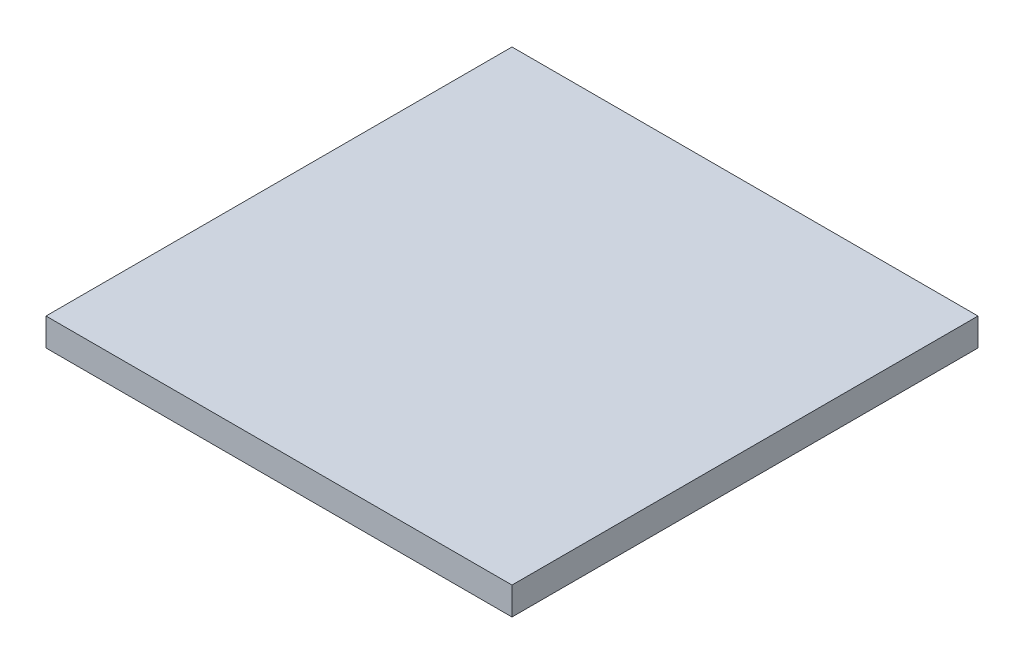
ISO-10303-21;
HEADER;
FILE_DESCRIPTION(('STEP AP214'),'2;1');
FILE_NAME('part.step','',(''),(''),'','','');
FILE_SCHEMA(('AUTOMOTIVE_DESIGN { 1 0 10303 214 1 1 1 1 }'));
ENDSEC;
DATA;
#1=APPLICATION_CONTEXT('core data for automotive mechanical design processes');
#2=APPLICATION_PROTOCOL_DEFINITION('international standard','automotive_design',2000,#1);
#3=PRODUCT_CONTEXT('',#1,'mechanical');
#4=PRODUCT('Part','Part','',(#3));
#5=PRODUCT_RELATED_PRODUCT_CATEGORY('part','',(#4));
#6=PRODUCT_DEFINITION_FORMATION('','',#4);
#7=PRODUCT_DEFINITION_CONTEXT('part definition',#1,'design');
#8=PRODUCT_DEFINITION('design','',#6,#7);
#9=PRODUCT_DEFINITION_SHAPE('','',#8);
#10=(LENGTH_UNIT() NAMED_UNIT(*) SI_UNIT(.MILLI.,.METRE.));
#11=(NAMED_UNIT(*) PLANE_ANGLE_UNIT() SI_UNIT($,.RADIAN.));
#12=(NAMED_UNIT(*) SI_UNIT($,.STERADIAN.) SOLID_ANGLE_UNIT());
#13=UNCERTAINTY_MEASURE_WITH_UNIT(LENGTH_MEASURE(1.E-05),#10,'distance_accuracy_value','');
#14=(GEOMETRIC_REPRESENTATION_CONTEXT(3) GLOBAL_UNCERTAINTY_ASSIGNED_CONTEXT((#13)) GLOBAL_UNIT_ASSIGNED_CONTEXT((#10,
#11,#12)) REPRESENTATION_CONTEXT('',''));
#15=CARTESIAN_POINT('',(0.,0.,0.));
#16=DIRECTION('',(0.,0.,1.));
#17=DIRECTION('',(1.,0.,0.));
#18=AXIS2_PLACEMENT_3D('',#15,#16,#17);
#19=CARTESIAN_POINT('',(0.,0.,0.));
#20=DIRECTION('',(0.,1.,0.));
#21=DIRECTION('',(1.,0.,0.));
#22=AXIS2_PLACEMENT_3D('',#19,#20,#21);
#23=PLANE('',#22);
#24=DIRECTION('',(-1.,0.,0.));
#25=VECTOR('',#24,1.);
#26=CARTESIAN_POINT('',(1.85,0.,-1.85));
#27=LINE('',#26,#25);
#28=CARTESIAN_POINT('',(1.85,0.,-1.85));
#29=VERTEX_POINT('',#28);
#30=CARTESIAN_POINT('',(-1.85,0.,-1.85));
#31=VERTEX_POINT('',#30);
#32=EDGE_CURVE('E11',#29,#31,#27,.T.);
#33=ORIENTED_EDGE('',*,*,#32,.F.);
#34=DIRECTION('',(0.,0.,-1.));
#35=VECTOR('',#34,1.);
#36=CARTESIAN_POINT('',(1.85,0.,1.85));
#37=LINE('',#36,#35);
#38=CARTESIAN_POINT('',(1.85,0.,1.85));
#39=VERTEX_POINT('',#38);
#40=EDGE_CURVE('E24',#39,#29,#37,.T.);
#41=ORIENTED_EDGE('',*,*,#40,.F.);
#42=DIRECTION('',(1.,0.,0.));
#43=VECTOR('',#42,1.);
#44=CARTESIAN_POINT('',(-1.85,0.,1.85));
#45=LINE('',#44,#43);
#46=CARTESIAN_POINT('',(-1.85,0.,1.85));
#47=VERTEX_POINT('',#46);
#48=EDGE_CURVE('E61',#47,#39,#45,.T.);
#49=ORIENTED_EDGE('',*,*,#48,.F.);
#50=DIRECTION('',(0.,0.,1.));
#51=VECTOR('',#50,1.);
#52=CARTESIAN_POINT('',(-1.85,0.,-1.85));
#53=LINE('',#52,#51);
#54=EDGE_CURVE('E37',#31,#47,#53,.T.);
#55=ORIENTED_EDGE('',*,*,#54,.F.);
#56=EDGE_LOOP('',(#33,#41,#49,#55));
#57=FACE_BOUND('',#56,.T.);
#58=ADVANCED_FACE('F17',(#57),#23,.F.);
#59=CARTESIAN_POINT('',(-1.85,0.,-1.85));
#60=DIRECTION('',(-1.,0.,0.));
#61=DIRECTION('',(0.,0.,1.));
#62=AXIS2_PLACEMENT_3D('',#59,#60,#61);
#63=PLANE('',#62);
#64=DIRECTION('',(0.,1.,0.));
#65=VECTOR('',#64,1.);
#66=CARTESIAN_POINT('',(-1.85,0.,1.85));
#67=LINE('',#66,#65);
#68=CARTESIAN_POINT('',(-1.85,0.22,1.85));
#69=VERTEX_POINT('',#68);
#70=EDGE_CURVE('E84',#47,#69,#67,.T.);
#71=ORIENTED_EDGE('',*,*,#70,.T.);
#72=DIRECTION('',(0.,0.,1.));
#73=VECTOR('',#72,1.);
#74=CARTESIAN_POINT('',(-1.85,0.22,-1.85));
#75=LINE('',#74,#73);
#76=CARTESIAN_POINT('',(-1.85,0.22,-1.85));
#77=VERTEX_POINT('',#76);
#78=EDGE_CURVE('E74',#77,#69,#75,.T.);
#79=ORIENTED_EDGE('',*,*,#78,.F.);
#80=DIRECTION('',(0.,1.,0.));
#81=VECTOR('',#80,1.);
#82=CARTESIAN_POINT('',(-1.85,0.,-1.85));
#83=LINE('',#82,#81);
#84=EDGE_CURVE('E81',#31,#77,#83,.T.);
#85=ORIENTED_EDGE('',*,*,#84,.F.);
#86=ORIENTED_EDGE('',*,*,#54,.T.);
#87=EDGE_LOOP('',(#71,#79,#85,#86));
#88=FACE_BOUND('',#87,.T.);
#89=ADVANCED_FACE('F89',(#88),#63,.T.);
#90=CARTESIAN_POINT('',(1.85,0.,-1.85));
#91=DIRECTION('',(0.,0.,-1.));
#92=DIRECTION('',(-1.,0.,0.));
#93=AXIS2_PLACEMENT_3D('',#90,#91,#92);
#94=PLANE('',#93);
#95=ORIENTED_EDGE('',*,*,#84,.T.);
#96=DIRECTION('',(-1.,0.,0.));
#97=VECTOR('',#96,1.);
#98=CARTESIAN_POINT('',(1.85,0.22,-1.85));
#99=LINE('',#98,#97);
#100=CARTESIAN_POINT('',(1.85,0.22,-1.85));
#101=VERTEX_POINT('',#100);
#102=EDGE_CURVE('E79',#101,#77,#99,.T.);
#103=ORIENTED_EDGE('',*,*,#102,.F.);
#104=DIRECTION('',(0.,1.,0.));
#105=VECTOR('',#104,1.);
#106=CARTESIAN_POINT('',(1.85,0.,-1.85));
#107=LINE('',#106,#105);
#108=EDGE_CURVE('E67',#29,#101,#107,.T.);
#109=ORIENTED_EDGE('',*,*,#108,.F.);
#110=ORIENTED_EDGE('',*,*,#32,.T.);
#111=EDGE_LOOP('',(#95,#103,#109,#110));
#112=FACE_BOUND('',#111,.T.);
#113=ADVANCED_FACE('F91',(#112),#94,.T.);
#114=CARTESIAN_POINT('',(1.85,0.,1.85));
#115=DIRECTION('',(1.,0.,0.));
#116=DIRECTION('',(0.,0.,-1.));
#117=AXIS2_PLACEMENT_3D('',#114,#115,#116);
#118=PLANE('',#117);
#119=ORIENTED_EDGE('',*,*,#108,.T.);
#120=DIRECTION('',(0.,0.,-1.));
#121=VECTOR('',#120,1.);
#122=CARTESIAN_POINT('',(1.85,0.22,1.85));
#123=LINE('',#122,#121);
#124=CARTESIAN_POINT('',(1.85,0.22,1.85));
#125=VERTEX_POINT('',#124);
#126=EDGE_CURVE('E62',#125,#101,#123,.T.);
#127=ORIENTED_EDGE('',*,*,#126,.F.);
#128=DIRECTION('',(0.,1.,0.));
#129=VECTOR('',#128,1.);
#130=CARTESIAN_POINT('',(1.85,0.,1.85));
#131=LINE('',#130,#129);
#132=EDGE_CURVE('E55',#39,#125,#131,.T.);
#133=ORIENTED_EDGE('',*,*,#132,.F.);
#134=ORIENTED_EDGE('',*,*,#40,.T.);
#135=EDGE_LOOP('',(#119,#127,#133,#134));
#136=FACE_BOUND('',#135,.T.);
#137=ADVANCED_FACE('F65',(#136),#118,.T.);
#138=CARTESIAN_POINT('',(-1.85,0.,1.85));
#139=DIRECTION('',(0.,0.,1.));
#140=DIRECTION('',(1.,0.,0.));
#141=AXIS2_PLACEMENT_3D('',#138,#139,#140);
#142=PLANE('',#141);
#143=ORIENTED_EDGE('',*,*,#132,.T.);
#144=DIRECTION('',(1.,0.,0.));
#145=VECTOR('',#144,1.);
#146=CARTESIAN_POINT('',(-1.85,0.22,1.85));
#147=LINE('',#146,#145);
#148=EDGE_CURVE('E60',#69,#125,#147,.T.);
#149=ORIENTED_EDGE('',*,*,#148,.F.);
#150=ORIENTED_EDGE('',*,*,#70,.F.);
#151=ORIENTED_EDGE('',*,*,#48,.T.);
#152=EDGE_LOOP('',(#143,#149,#150,#151));
#153=FACE_BOUND('',#152,.T.);
#154=ADVANCED_FACE('F57',(#153),#142,.T.);
#155=CARTESIAN_POINT('',(0.,0.22,0.));
#156=DIRECTION('',(0.,1.,0.));
#157=DIRECTION('',(1.,0.,0.));
#158=AXIS2_PLACEMENT_3D('',#155,#156,#157);
#159=PLANE('',#158);
#160=ORIENTED_EDGE('',*,*,#148,.T.);
#161=ORIENTED_EDGE('',*,*,#126,.T.);
#162=ORIENTED_EDGE('',*,*,#102,.T.);
#163=ORIENTED_EDGE('',*,*,#78,.T.);
#164=EDGE_LOOP('',(#160,#161,#162,#163));
#165=FACE_BOUND('',#164,.T.);
#166=ADVANCED_FACE('F72',(#165),#159,.T.);
#167=CLOSED_SHELL('',(#58,#89,#113,#137,#154,#166));
#168=MANIFOLD_SOLID_BREP('B1',#167);
#169=ADVANCED_BREP_SHAPE_REPRESENTATION('',(#18,#168),#14);
#170=SHAPE_DEFINITION_REPRESENTATION(#9,#169);
ENDSEC;
END-ISO-10303-21;
